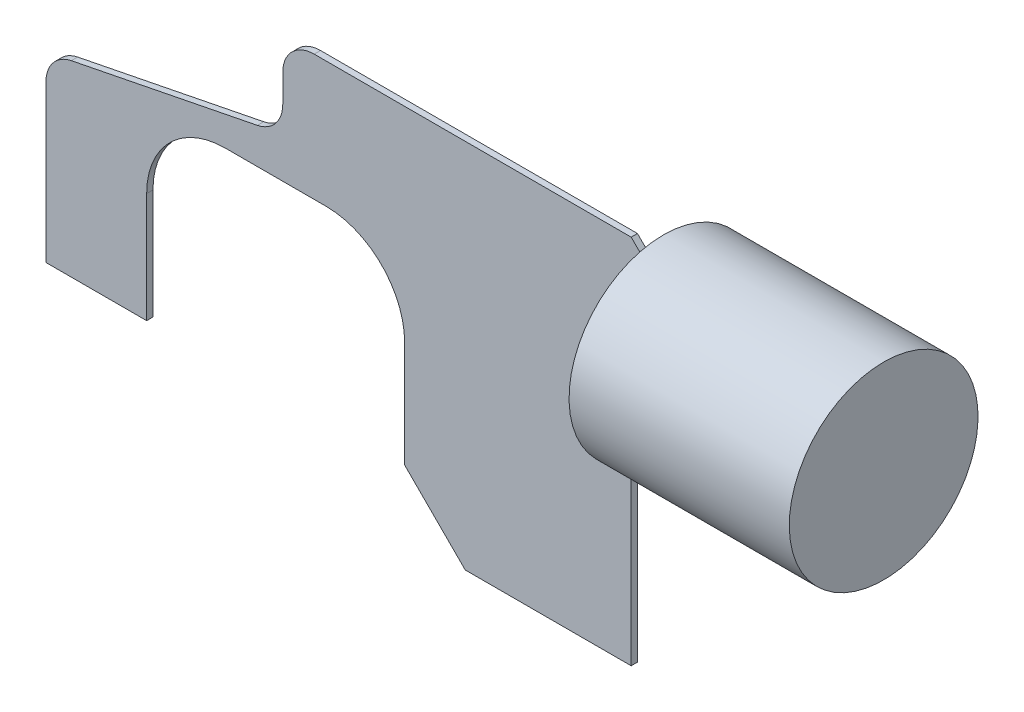
ISO-10303-21;
HEADER;
FILE_DESCRIPTION(('STEP AP214'),'2;1');
FILE_NAME('part.step','',(''),(''),'','','');
FILE_SCHEMA(('AUTOMOTIVE_DESIGN { 1 0 10303 214 1 1 1 1 }'));
ENDSEC;
DATA;
#1=APPLICATION_CONTEXT('core data for automotive mechanical design processes');
#2=APPLICATION_PROTOCOL_DEFINITION('international standard','automotive_design',2000,#1);
#3=PRODUCT_CONTEXT('',#1,'mechanical');
#4=PRODUCT('Part','Part','',(#3));
#5=PRODUCT_RELATED_PRODUCT_CATEGORY('part','',(#4));
#6=PRODUCT_DEFINITION_FORMATION('','',#4);
#7=PRODUCT_DEFINITION_CONTEXT('part definition',#1,'design');
#8=PRODUCT_DEFINITION('design','',#6,#7);
#9=PRODUCT_DEFINITION_SHAPE('','',#8);
#10=(LENGTH_UNIT() NAMED_UNIT(*) SI_UNIT(.MILLI.,.METRE.));
#11=(NAMED_UNIT(*) PLANE_ANGLE_UNIT() SI_UNIT($,.RADIAN.));
#12=(NAMED_UNIT(*) SI_UNIT($,.STERADIAN.) SOLID_ANGLE_UNIT());
#13=UNCERTAINTY_MEASURE_WITH_UNIT(LENGTH_MEASURE(1.E-05),#10,'distance_accuracy_value','');
#14=(GEOMETRIC_REPRESENTATION_CONTEXT(3) GLOBAL_UNCERTAINTY_ASSIGNED_CONTEXT((#13)) GLOBAL_UNIT_ASSIGNED_CONTEXT((#10,
#11,#12)) REPRESENTATION_CONTEXT('',''));
#15=CARTESIAN_POINT('',(0.,0.,0.));
#16=DIRECTION('',(0.,0.,1.));
#17=DIRECTION('',(1.,0.,0.));
#18=AXIS2_PLACEMENT_3D('',#15,#16,#17);
#19=CARTESIAN_POINT('',(0.,0.,-0.127));
#20=DIRECTION('',(-1.,0.,0.));
#21=DIRECTION('',(0.,0.,1.));
#22=AXIS2_PLACEMENT_3D('',#19,#20,#21);
#23=PLANE('',#22);
#24=DIRECTION('',(0.,-1.,0.));
#25=VECTOR('',#24,1.);
#26=CARTESIAN_POINT('',(0.,0.,0.127));
#27=LINE('',#26,#25);
#28=CARTESIAN_POINT('',(0.,6.32367812699813,0.127));
#29=VERTEX_POINT('',#28);
#30=CARTESIAN_POINT('',(0.,0.,0.127));
#31=VERTEX_POINT('',#30);
#32=EDGE_CURVE('E121',#29,#31,#27,.T.);
#33=ORIENTED_EDGE('',*,*,#32,.F.);
#34=DIRECTION('',(0.,0.,-1.));
#35=VECTOR('',#34,1.);
#36=CARTESIAN_POINT('',(0.,6.32367812699813,2.413));
#37=LINE('',#36,#35);
#38=CARTESIAN_POINT('',(0.,6.32367812699813,-0.127));
#39=VERTEX_POINT('',#38);
#40=EDGE_CURVE('E276',#29,#39,#37,.T.);
#41=ORIENTED_EDGE('',*,*,#40,.T.);
#42=DIRECTION('',(0.,-1.,0.));
#43=VECTOR('',#42,1.);
#44=CARTESIAN_POINT('',(0.,0.,-0.127));
#45=LINE('',#44,#43);
#46=CARTESIAN_POINT('',(0.,0.,-0.127));
#47=VERTEX_POINT('',#46);
#48=EDGE_CURVE('E74',#39,#47,#45,.T.);
#49=ORIENTED_EDGE('',*,*,#48,.T.);
#50=DIRECTION('',(0.,0.,1.));
#51=VECTOR('',#50,1.);
#52=CARTESIAN_POINT('',(0.,0.,-0.127));
#53=LINE('',#52,#51);
#54=EDGE_CURVE('E236',#47,#31,#53,.T.);
#55=ORIENTED_EDGE('',*,*,#54,.T.);
#56=EDGE_LOOP('',(#33,#41,#49,#55));
#57=FACE_BOUND('',#56,.T.);
#58=ADVANCED_FACE('F50',(#57),#23,.T.);
#59=CARTESIAN_POINT('',(3.175,9.525,-0.127));
#60=DIRECTION('',(0.,0.,-1.));
#61=DIRECTION('',(-1.,0.,0.));
#62=AXIS2_PLACEMENT_3D('',#59,#60,#61);
#63=PLANE('',#62);
#64=DIRECTION('',(0.,-1.,0.));
#65=VECTOR('',#64,1.);
#66=CARTESIAN_POINT('',(9.55704806959373,0.,-0.127));
#67=LINE('',#66,#65);
#68=CARTESIAN_POINT('',(9.55704806959373,11.43,-0.127));
#69=VERTEX_POINT('',#68);
#70=CARTESIAN_POINT('',(9.55704806959373,10.3087777878284,-0.127));
#71=VERTEX_POINT('',#70);
#72=EDGE_CURVE('E414',#69,#71,#67,.T.);
#73=ORIENTED_EDGE('',*,*,#72,.F.);
#74=CARTESIAN_POINT('',(10.8270480695937,11.43,-0.127));
#75=DIRECTION('',(0.,0.,-1.));
#76=DIRECTION('',(-1.,0.,0.));
#77=AXIS2_PLACEMENT_3D('',#74,#75,#76);
#78=CIRCLE('',#77,1.27);
#79=CARTESIAN_POINT('',(10.8270480695937,12.7,-0.127));
#80=VERTEX_POINT('',#79);
#81=EDGE_CURVE('E416',#69,#80,#78,.T.);
#82=ORIENTED_EDGE('',*,*,#81,.T.);
#83=DIRECTION('',(-1.,0.,0.));
#84=VECTOR('',#83,1.);
#85=CARTESIAN_POINT('',(3.17500000000002,12.7,-0.127));
#86=LINE('',#85,#84);
#87=CARTESIAN_POINT('',(23.622,12.7,-0.127));
#88=VERTEX_POINT('',#87);
#89=EDGE_CURVE('E184',#88,#80,#86,.T.);
#90=ORIENTED_EDGE('',*,*,#89,.F.);
#91=DIRECTION('',(-0.707106781186548,0.707106781186547,0.));
#92=VECTOR('',#91,1.);
#93=CARTESIAN_POINT('',(23.622,12.7,-0.127));
#94=LINE('',#93,#92);
#95=CARTESIAN_POINT('',(24.7970480695937,11.5249519304063,-0.127));
#96=VERTEX_POINT('',#95);
#97=EDGE_CURVE('E166',#96,#88,#94,.T.);
#98=ORIENTED_EDGE('',*,*,#97,.F.);
#99=DIRECTION('',(0.,1.,0.));
#100=VECTOR('',#99,1.);
#101=CARTESIAN_POINT('',(24.7970480695937,11.5249519304063,-0.127));
#102=LINE('',#101,#100);
#103=CARTESIAN_POINT('',(24.7970480695937,7.52504806959373,-0.127));
#104=VERTEX_POINT('',#103);
#105=EDGE_CURVE('E180',#104,#96,#102,.T.);
#106=ORIENTED_EDGE('',*,*,#105,.F.);
#107=DIRECTION('',(0.707106781186549,0.707106781186547,0.));
#108=VECTOR('',#107,1.);
#109=CARTESIAN_POINT('',(24.7970480695937,7.52504806959373,-0.127));
#110=LINE('',#109,#108);
#111=CARTESIAN_POINT('',(23.622,6.35,-0.127));
#112=VERTEX_POINT('',#111);
#113=EDGE_CURVE('E189',#112,#104,#110,.T.);
#114=ORIENTED_EDGE('',*,*,#113,.F.);
#115=DIRECTION('',(0.,1.,0.));
#116=VECTOR('',#115,1.);
#117=CARTESIAN_POINT('',(23.622,6.35,-0.127));
#118=LINE('',#117,#116);
#119=CARTESIAN_POINT('',(23.622,-2.286,-0.127));
#120=VERTEX_POINT('',#119);
#121=EDGE_CURVE('E191',#120,#112,#118,.T.);
#122=ORIENTED_EDGE('',*,*,#121,.F.);
#123=DIRECTION('',(1.,0.,0.));
#124=VECTOR('',#123,1.);
#125=CARTESIAN_POINT('',(23.622,-2.286,-0.127));
#126=LINE('',#125,#124);
#127=CARTESIAN_POINT('',(16.9236964602605,-2.286,-0.127));
#128=VERTEX_POINT('',#127);
#129=EDGE_CURVE('E334',#128,#120,#126,.T.);
#130=ORIENTED_EDGE('',*,*,#129,.F.);
#131=DIRECTION('',(0.707106781186548,-0.707106781186547,0.));
#132=VECTOR('',#131,1.);
#133=CARTESIAN_POINT('',(16.9236964602605,-2.286,-0.127));
#134=LINE('',#133,#132);
#135=CARTESIAN_POINT('',(14.478,0.159696460260486,-0.127));
#136=VERTEX_POINT('',#135);
#137=EDGE_CURVE('E331',#136,#128,#134,.T.);
#138=ORIENTED_EDGE('',*,*,#137,.F.);
#139=DIRECTION('',(0.,-1.,0.));
#140=VECTOR('',#139,1.);
#141=CARTESIAN_POINT('',(14.478,0.159696460260486,-0.127));
#142=LINE('',#141,#140);
#143=CARTESIAN_POINT('',(14.478,4.445,-0.127));
#144=VERTEX_POINT('',#143);
#145=EDGE_CURVE('E328',#144,#136,#142,.T.);
#146=ORIENTED_EDGE('',*,*,#145,.F.);
#147=CARTESIAN_POINT('',(11.303,4.445,-0.127));
#148=DIRECTION('',(0.,0.,-1.));
#149=DIRECTION('',(1.,0.,0.));
#150=AXIS2_PLACEMENT_3D('',#147,#148,#149);
#151=CIRCLE('',#150,3.175);
#152=CARTESIAN_POINT('',(11.303,7.62,-0.127));
#153=VERTEX_POINT('',#152);
#154=EDGE_CURVE('E325',#153,#144,#151,.T.);
#155=ORIENTED_EDGE('',*,*,#154,.F.);
#156=DIRECTION('',(1.,0.,0.));
#157=VECTOR('',#156,1.);
#158=CARTESIAN_POINT('',(11.303,7.62,-0.127));
#159=LINE('',#158,#157);
#160=CARTESIAN_POINT('',(7.239,7.62,-0.127));
#161=VERTEX_POINT('',#160);
#162=EDGE_CURVE('E322',#161,#153,#159,.T.);
#163=ORIENTED_EDGE('',*,*,#162,.F.);
#164=CARTESIAN_POINT('',(7.239,4.445,-0.127));
#165=DIRECTION('',(0.,0.,-1.));
#166=DIRECTION('',(1.,0.,0.));
#167=AXIS2_PLACEMENT_3D('',#164,#165,#166);
#168=CIRCLE('',#167,3.175);
#169=CARTESIAN_POINT('',(4.064,4.445,-0.127));
#170=VERTEX_POINT('',#169);
#171=EDGE_CURVE('E319',#170,#161,#168,.T.);
#172=ORIENTED_EDGE('',*,*,#171,.F.);
#173=DIRECTION('',(0.,1.,0.));
#174=VECTOR('',#173,1.);
#175=CARTESIAN_POINT('',(4.064,4.445,-0.127));
#176=LINE('',#175,#174);
#177=CARTESIAN_POINT('',(4.064,0.,-0.127));
#178=VERTEX_POINT('',#177);
#179=EDGE_CURVE('E317',#178,#170,#176,.T.);
#180=ORIENTED_EDGE('',*,*,#179,.F.);
#181=DIRECTION('',(1.,0.,0.));
#182=VECTOR('',#181,1.);
#183=CARTESIAN_POINT('',(4.064,0.,-0.127));
#184=LINE('',#183,#182);
#185=EDGE_CURVE('E235',#47,#178,#184,.T.);
#186=ORIENTED_EDGE('',*,*,#185,.F.);
#187=ORIENTED_EDGE('',*,*,#48,.F.);
#188=CARTESIAN_POINT('',(1.27,6.32367812699814,-0.127));
#189=DIRECTION('',(0.,0.,-1.));
#190=DIRECTION('',(-1.,0.,0.));
#191=AXIS2_PLACEMENT_3D('',#188,#189,#190);
#192=CIRCLE('',#191,1.27);
#193=CARTESIAN_POINT('',(1.02230539314557,7.56928937523542,-0.127));
#194=VERTEX_POINT('',#193);
#195=EDGE_CURVE('E308',#39,#194,#192,.T.);
#196=ORIENTED_EDGE('',*,*,#195,.T.);
#197=DIRECTION('',(-0.980796258454548,-0.195035123507434,0.));
#198=VECTOR('',#197,1.);
#199=CARTESIAN_POINT('',(-1.40904007312479,7.08580694020811,-0.127));
#200=LINE('',#199,#198);
#201=CARTESIAN_POINT('',(8.53474267644816,9.06316653959113,-0.127));
#202=VERTEX_POINT('',#201);
#203=EDGE_CURVE('E285',#202,#194,#200,.T.);
#204=ORIENTED_EDGE('',*,*,#203,.F.);
#205=CARTESIAN_POINT('',(8.28704806959373,10.3087777878284,-0.127));
#206=DIRECTION('',(0.,0.,-1.));
#207=DIRECTION('',(-1.,0.,0.));
#208=AXIS2_PLACEMENT_3D('',#205,#206,#207);
#209=CIRCLE('',#208,1.27);
#210=EDGE_CURVE('E300',#202,#71,#209,.F.);
#211=ORIENTED_EDGE('',*,*,#210,.T.);
#212=EDGE_LOOP('',(#73,#82,#90,#98,#106,#114,#122,#130,#138,#146,#155,#163,#172,#180,#186,#187,
#196,#204,#211));
#213=FACE_BOUND('',#212,.T.);
#214=ADVANCED_FACE('F178',(#213),#63,.T.);
#215=CARTESIAN_POINT('',(3.175,9.525,0.127));
#216=DIRECTION('',(0.,0.,-1.));
#217=DIRECTION('',(-1.,0.,0.));
#218=AXIS2_PLACEMENT_3D('',#215,#216,#217);
#219=PLANE('',#218);
#220=CARTESIAN_POINT('',(10.8270480695937,11.43,0.127));
#221=DIRECTION('',(0.,0.,-1.));
#222=DIRECTION('',(-1.,0.,0.));
#223=AXIS2_PLACEMENT_3D('',#220,#221,#222);
#224=CIRCLE('',#223,1.27);
#225=CARTESIAN_POINT('',(9.55704806959373,11.43,0.127));
#226=VERTEX_POINT('',#225);
#227=CARTESIAN_POINT('',(10.8270480695937,12.7,0.127));
#228=VERTEX_POINT('',#227);
#229=EDGE_CURVE('E13',#226,#228,#224,.T.);
#230=ORIENTED_EDGE('',*,*,#229,.F.);
#231=DIRECTION('',(0.,-1.,0.));
#232=VECTOR('',#231,1.);
#233=CARTESIAN_POINT('',(9.55704806959373,9.525,0.127));
#234=LINE('',#233,#232);
#235=CARTESIAN_POINT('',(9.55704806959373,10.3087777878284,0.127));
#236=VERTEX_POINT('',#235);
#237=EDGE_CURVE('E238',#226,#236,#234,.T.);
#238=ORIENTED_EDGE('',*,*,#237,.T.);
#239=CARTESIAN_POINT('',(8.28704806959373,10.3087777878284,0.127));
#240=DIRECTION('',(0.,0.,-1.));
#241=DIRECTION('',(-1.,0.,0.));
#242=AXIS2_PLACEMENT_3D('',#239,#240,#241);
#243=CIRCLE('',#242,1.27);
#244=CARTESIAN_POINT('',(8.53474267644816,9.06316653959113,0.127));
#245=VERTEX_POINT('',#244);
#246=EDGE_CURVE('E260',#245,#236,#243,.F.);
#247=ORIENTED_EDGE('',*,*,#246,.F.);
#248=DIRECTION('',(-0.980796258454548,-0.195035123507434,0.));
#249=VECTOR('',#248,1.);
#250=CARTESIAN_POINT('',(3.4672216335918,8.05547041111348,0.127));
#251=LINE('',#250,#249);
#252=CARTESIAN_POINT('',(1.02230539314557,7.56928937523542,0.127));
#253=VERTEX_POINT('',#252);
#254=EDGE_CURVE('E262',#245,#253,#251,.T.);
#255=ORIENTED_EDGE('',*,*,#254,.T.);
#256=CARTESIAN_POINT('',(1.27,6.32367812699814,0.127));
#257=DIRECTION('',(0.,0.,-1.));
#258=DIRECTION('',(-1.,0.,0.));
#259=AXIS2_PLACEMENT_3D('',#256,#257,#258);
#260=CIRCLE('',#259,1.27);
#261=EDGE_CURVE('E58',#29,#253,#260,.T.);
#262=ORIENTED_EDGE('',*,*,#261,.F.);
#263=ORIENTED_EDGE('',*,*,#32,.T.);
#264=DIRECTION('',(1.,0.,0.));
#265=VECTOR('',#264,1.);
#266=CARTESIAN_POINT('',(4.064,0.,0.127));
#267=LINE('',#266,#265);
#268=CARTESIAN_POINT('',(4.064,0.,0.127));
#269=VERTEX_POINT('',#268);
#270=EDGE_CURVE('E197',#31,#269,#267,.T.);
#271=ORIENTED_EDGE('',*,*,#270,.T.);
#272=DIRECTION('',(0.,1.,0.));
#273=VECTOR('',#272,1.);
#274=CARTESIAN_POINT('',(4.064,4.445,0.127));
#275=LINE('',#274,#273);
#276=CARTESIAN_POINT('',(4.064,4.445,0.127));
#277=VERTEX_POINT('',#276);
#278=EDGE_CURVE('E199',#269,#277,#275,.T.);
#279=ORIENTED_EDGE('',*,*,#278,.T.);
#280=CARTESIAN_POINT('',(7.239,4.445,0.127));
#281=DIRECTION('',(0.,0.,-1.));
#282=DIRECTION('',(1.,0.,0.));
#283=AXIS2_PLACEMENT_3D('',#280,#281,#282);
#284=CIRCLE('',#283,3.175);
#285=CARTESIAN_POINT('',(7.239,7.62,0.127));
#286=VERTEX_POINT('',#285);
#287=EDGE_CURVE('E203',#277,#286,#284,.T.);
#288=ORIENTED_EDGE('',*,*,#287,.T.);
#289=DIRECTION('',(1.,0.,0.));
#290=VECTOR('',#289,1.);
#291=CARTESIAN_POINT('',(11.303,7.62,0.127));
#292=LINE('',#291,#290);
#293=CARTESIAN_POINT('',(11.303,7.62,0.127));
#294=VERTEX_POINT('',#293);
#295=EDGE_CURVE('E206',#286,#294,#292,.T.);
#296=ORIENTED_EDGE('',*,*,#295,.T.);
#297=CARTESIAN_POINT('',(11.303,4.445,0.127));
#298=DIRECTION('',(0.,0.,-1.));
#299=DIRECTION('',(1.,0.,0.));
#300=AXIS2_PLACEMENT_3D('',#297,#298,#299);
#301=CIRCLE('',#300,3.175);
#302=CARTESIAN_POINT('',(14.478,4.445,0.127));
#303=VERTEX_POINT('',#302);
#304=EDGE_CURVE('E209',#294,#303,#301,.T.);
#305=ORIENTED_EDGE('',*,*,#304,.T.);
#306=DIRECTION('',(0.,-1.,0.));
#307=VECTOR('',#306,1.);
#308=CARTESIAN_POINT('',(14.478,0.159696460260486,0.127));
#309=LINE('',#308,#307);
#310=CARTESIAN_POINT('',(14.478,0.159696460260486,0.127));
#311=VERTEX_POINT('',#310);
#312=EDGE_CURVE('E212',#303,#311,#309,.T.);
#313=ORIENTED_EDGE('',*,*,#312,.T.);
#314=DIRECTION('',(0.707106781186548,-0.707106781186547,0.));
#315=VECTOR('',#314,1.);
#316=CARTESIAN_POINT('',(16.9236964602605,-2.286,0.127));
#317=LINE('',#316,#315);
#318=CARTESIAN_POINT('',(16.9236964602605,-2.286,0.127));
#319=VERTEX_POINT('',#318);
#320=EDGE_CURVE('E215',#311,#319,#317,.T.);
#321=ORIENTED_EDGE('',*,*,#320,.T.);
#322=DIRECTION('',(1.,0.,0.));
#323=VECTOR('',#322,1.);
#324=CARTESIAN_POINT('',(23.622,-2.286,0.127));
#325=LINE('',#324,#323);
#326=CARTESIAN_POINT('',(23.622,-2.286,0.127));
#327=VERTEX_POINT('',#326);
#328=EDGE_CURVE('E218',#319,#327,#325,.T.);
#329=ORIENTED_EDGE('',*,*,#328,.T.);
#330=DIRECTION('',(0.,1.,0.));
#331=VECTOR('',#330,1.);
#332=CARTESIAN_POINT('',(23.622,6.35,0.127));
#333=LINE('',#332,#331);
#334=CARTESIAN_POINT('',(23.622,6.35,0.127));
#335=VERTEX_POINT('',#334);
#336=EDGE_CURVE('E221',#327,#335,#333,.T.);
#337=ORIENTED_EDGE('',*,*,#336,.T.);
#338=DIRECTION('',(0.707106781186549,0.707106781186547,0.));
#339=VECTOR('',#338,1.);
#340=CARTESIAN_POINT('',(24.7970480695937,7.52504806959373,0.127));
#341=LINE('',#340,#339);
#342=CARTESIAN_POINT('',(24.7970480695937,7.52504806959373,0.127));
#343=VERTEX_POINT('',#342);
#344=EDGE_CURVE('E224',#335,#343,#341,.T.);
#345=ORIENTED_EDGE('',*,*,#344,.T.);
#346=DIRECTION('',(0.,1.,0.));
#347=VECTOR('',#346,1.);
#348=CARTESIAN_POINT('',(24.7970480695937,11.5249519304063,0.127));
#349=LINE('',#348,#347);
#350=CARTESIAN_POINT('',(24.7970480695937,11.5249519304063,0.127));
#351=VERTEX_POINT('',#350);
#352=EDGE_CURVE('E227',#343,#351,#349,.T.);
#353=ORIENTED_EDGE('',*,*,#352,.T.);
#354=DIRECTION('',(-0.707106781186548,0.707106781186547,0.));
#355=VECTOR('',#354,1.);
#356=CARTESIAN_POINT('',(23.622,12.7,0.127));
#357=LINE('',#356,#355);
#358=CARTESIAN_POINT('',(23.622,12.7,0.127));
#359=VERTEX_POINT('',#358);
#360=EDGE_CURVE('E168',#351,#359,#357,.T.);
#361=ORIENTED_EDGE('',*,*,#360,.T.);
#362=DIRECTION('',(-1.,0.,0.));
#363=VECTOR('',#362,1.);
#364=CARTESIAN_POINT('',(3.17500000000002,12.7,0.127));
#365=LINE('',#364,#363);
#366=EDGE_CURVE('E231',#359,#228,#365,.T.);
#367=ORIENTED_EDGE('',*,*,#366,.T.);
#368=EDGE_LOOP('',(#230,#238,#247,#255,#262,#263,#271,#279,#288,#296,#305,#313,#321,#329,#337,
#345,#353,#361,#367));
#369=FACE_BOUND('',#368,.T.);
#370=ADVANCED_FACE('F291',(#369),#219,.F.);
#371=CARTESIAN_POINT('',(4.064,0.,-0.127));
#372=DIRECTION('',(0.,-1.,0.));
#373=DIRECTION('',(1.,0.,0.));
#374=AXIS2_PLACEMENT_3D('',#371,#372,#373);
#375=PLANE('',#374);
#376=ORIENTED_EDGE('',*,*,#270,.F.);
#377=ORIENTED_EDGE('',*,*,#54,.F.);
#378=ORIENTED_EDGE('',*,*,#185,.T.);
#379=DIRECTION('',(0.,0.,1.));
#380=VECTOR('',#379,1.);
#381=CARTESIAN_POINT('',(4.064,0.,-0.127));
#382=LINE('',#381,#380);
#383=EDGE_CURVE('E128',#178,#269,#382,.T.);
#384=ORIENTED_EDGE('',*,*,#383,.T.);
#385=EDGE_LOOP('',(#376,#377,#378,#384));
#386=FACE_BOUND('',#385,.T.);
#387=ADVANCED_FACE('F52',(#386),#375,.T.);
#388=CARTESIAN_POINT('',(3.17500000000002,12.7,-0.127));
#389=DIRECTION('',(0.,1.,0.));
#390=DIRECTION('',(0.,0.,1.));
#391=AXIS2_PLACEMENT_3D('',#388,#389,#390);
#392=PLANE('',#391);
#393=DIRECTION('',(0.,0.,-1.));
#394=VECTOR('',#393,1.);
#395=CARTESIAN_POINT('',(10.8270480695937,12.7,2.413));
#396=LINE('',#395,#394);
#397=EDGE_CURVE('E314',#228,#80,#396,.T.);
#398=ORIENTED_EDGE('',*,*,#397,.F.);
#399=ORIENTED_EDGE('',*,*,#366,.F.);
#400=DIRECTION('',(0.,0.,1.));
#401=VECTOR('',#400,1.);
#402=CARTESIAN_POINT('',(23.622,12.7,-0.127));
#403=LINE('',#402,#401);
#404=EDGE_CURVE('E172',#88,#359,#403,.T.);
#405=ORIENTED_EDGE('',*,*,#404,.F.);
#406=ORIENTED_EDGE('',*,*,#89,.T.);
#407=EDGE_LOOP('',(#398,#399,#405,#406));
#408=FACE_BOUND('',#407,.T.);
#409=ADVANCED_FACE('F392',(#408),#392,.T.);
#410=CARTESIAN_POINT('',(23.622,12.7,-0.127));
#411=DIRECTION('',(0.707106781186547,0.707106781186548,0.));
#412=DIRECTION('',(-0.707106781186548,0.707106781186547,0.));
#413=AXIS2_PLACEMENT_3D('',#410,#411,#412);
#414=PLANE('',#413);
#415=ORIENTED_EDGE('',*,*,#360,.F.);
#416=DIRECTION('',(0.,0.,1.));
#417=VECTOR('',#416,1.);
#418=CARTESIAN_POINT('',(24.7970480695937,11.5249519304063,-0.127));
#419=LINE('',#418,#417);
#420=EDGE_CURVE('E163',#96,#351,#419,.T.);
#421=ORIENTED_EDGE('',*,*,#420,.F.);
#422=ORIENTED_EDGE('',*,*,#97,.T.);
#423=ORIENTED_EDGE('',*,*,#404,.T.);
#424=EDGE_LOOP('',(#415,#421,#422,#423));
#425=FACE_BOUND('',#424,.T.);
#426=ADVANCED_FACE('F165',(#425),#414,.T.);
#427=CARTESIAN_POINT('',(24.7970480695937,7.52504806959373,-0.127));
#428=DIRECTION('',(0.707106781186546,-0.707106781186549,0.));
#429=DIRECTION('',(0.707106781186549,0.707106781186546,0.));
#430=AXIS2_PLACEMENT_3D('',#427,#428,#429);
#431=PLANE('',#430);
#432=ORIENTED_EDGE('',*,*,#344,.F.);
#433=DIRECTION('',(0.,0.,1.));
#434=VECTOR('',#433,1.);
#435=CARTESIAN_POINT('',(23.622,6.35,-0.127));
#436=LINE('',#435,#434);
#437=EDGE_CURVE('E241',#112,#335,#436,.T.);
#438=ORIENTED_EDGE('',*,*,#437,.F.);
#439=ORIENTED_EDGE('',*,*,#113,.T.);
#440=DIRECTION('',(0.,0.,1.));
#441=VECTOR('',#440,1.);
#442=CARTESIAN_POINT('',(24.7970480695937,7.52504806959373,-0.127));
#443=LINE('',#442,#441);
#444=EDGE_CURVE('E173',#104,#343,#443,.T.);
#445=ORIENTED_EDGE('',*,*,#444,.T.);
#446=EDGE_LOOP('',(#432,#438,#439,#445));
#447=FACE_BOUND('',#446,.T.);
#448=ADVANCED_FACE('F384',(#447),#431,.T.);
#449=CARTESIAN_POINT('',(23.622,6.35,-0.127));
#450=DIRECTION('',(1.,0.,0.));
#451=DIRECTION('',(0.,0.,-1.));
#452=AXIS2_PLACEMENT_3D('',#449,#450,#451);
#453=PLANE('',#452);
#454=ORIENTED_EDGE('',*,*,#336,.F.);
#455=DIRECTION('',(0.,0.,1.));
#456=VECTOR('',#455,1.);
#457=CARTESIAN_POINT('',(23.622,-2.286,-0.127));
#458=LINE('',#457,#456);
#459=EDGE_CURVE('E243',#120,#327,#458,.T.);
#460=ORIENTED_EDGE('',*,*,#459,.F.);
#461=ORIENTED_EDGE('',*,*,#121,.T.);
#462=ORIENTED_EDGE('',*,*,#437,.T.);
#463=EDGE_LOOP('',(#454,#460,#461,#462));
#464=FACE_BOUND('',#463,.T.);
#465=ADVANCED_FACE('F340',(#464),#453,.T.);
#466=CARTESIAN_POINT('',(23.622,-2.286,-0.127));
#467=DIRECTION('',(0.,-1.,0.));
#468=DIRECTION('',(1.,0.,0.));
#469=AXIS2_PLACEMENT_3D('',#466,#467,#468);
#470=PLANE('',#469);
#471=ORIENTED_EDGE('',*,*,#328,.F.);
#472=DIRECTION('',(0.,0.,1.));
#473=VECTOR('',#472,1.);
#474=CARTESIAN_POINT('',(16.9236964602605,-2.286,-0.127));
#475=LINE('',#474,#473);
#476=EDGE_CURVE('E245',#128,#319,#475,.T.);
#477=ORIENTED_EDGE('',*,*,#476,.F.);
#478=ORIENTED_EDGE('',*,*,#129,.T.);
#479=ORIENTED_EDGE('',*,*,#459,.T.);
#480=EDGE_LOOP('',(#471,#477,#478,#479));
#481=FACE_BOUND('',#480,.T.);
#482=ADVANCED_FACE('F346',(#481),#470,.T.);
#483=CARTESIAN_POINT('',(16.9236964602605,-2.286,-0.127));
#484=DIRECTION('',(-0.707106781186547,-0.707106781186548,0.));
#485=DIRECTION('',(0.707106781186548,-0.707106781186547,0.));
#486=AXIS2_PLACEMENT_3D('',#483,#484,#485);
#487=PLANE('',#486);
#488=ORIENTED_EDGE('',*,*,#320,.F.);
#489=DIRECTION('',(0.,0.,1.));
#490=VECTOR('',#489,1.);
#491=CARTESIAN_POINT('',(14.478,0.159696460260486,-0.127));
#492=LINE('',#491,#490);
#493=EDGE_CURVE('E247',#136,#311,#492,.T.);
#494=ORIENTED_EDGE('',*,*,#493,.F.);
#495=ORIENTED_EDGE('',*,*,#137,.T.);
#496=ORIENTED_EDGE('',*,*,#476,.T.);
#497=EDGE_LOOP('',(#488,#494,#495,#496));
#498=FACE_BOUND('',#497,.T.);
#499=ADVANCED_FACE('F349',(#498),#487,.T.);
#500=CARTESIAN_POINT('',(14.478,0.159696460260486,-0.127));
#501=DIRECTION('',(-1.,0.,0.));
#502=DIRECTION('',(0.,0.,1.));
#503=AXIS2_PLACEMENT_3D('',#500,#501,#502);
#504=PLANE('',#503);
#505=ORIENTED_EDGE('',*,*,#312,.F.);
#506=DIRECTION('',(0.,0.,1.));
#507=VECTOR('',#506,1.);
#508=CARTESIAN_POINT('',(14.478,4.445,-0.127));
#509=LINE('',#508,#507);
#510=EDGE_CURVE('E249',#144,#303,#509,.T.);
#511=ORIENTED_EDGE('',*,*,#510,.F.);
#512=ORIENTED_EDGE('',*,*,#145,.T.);
#513=ORIENTED_EDGE('',*,*,#493,.T.);
#514=EDGE_LOOP('',(#505,#511,#512,#513));
#515=FACE_BOUND('',#514,.T.);
#516=ADVANCED_FACE('F354',(#515),#504,.T.);
#517=CARTESIAN_POINT('',(11.303,4.445,-0.127));
#518=DIRECTION('',(0.,0.,1.));
#519=DIRECTION('',(1.,0.,0.));
#520=AXIS2_PLACEMENT_3D('',#517,#518,#519);
#521=CYLINDRICAL_SURFACE('',#520,3.175);
#522=ORIENTED_EDGE('',*,*,#304,.F.);
#523=DIRECTION('',(0.,0.,1.));
#524=VECTOR('',#523,1.);
#525=CARTESIAN_POINT('',(11.303,7.62,-0.127));
#526=LINE('',#525,#524);
#527=EDGE_CURVE('E251',#153,#294,#526,.T.);
#528=ORIENTED_EDGE('',*,*,#527,.F.);
#529=ORIENTED_EDGE('',*,*,#154,.T.);
#530=ORIENTED_EDGE('',*,*,#510,.T.);
#531=EDGE_LOOP('',(#522,#528,#529,#530));
#532=FACE_BOUND('',#531,.T.);
#533=ADVANCED_FACE('F357',(#532),#521,.F.);
#534=CARTESIAN_POINT('',(11.303,7.62,-0.127));
#535=DIRECTION('',(0.,-1.,0.));
#536=DIRECTION('',(1.,0.,0.));
#537=AXIS2_PLACEMENT_3D('',#534,#535,#536);
#538=PLANE('',#537);
#539=ORIENTED_EDGE('',*,*,#295,.F.);
#540=DIRECTION('',(0.,0.,1.));
#541=VECTOR('',#540,1.);
#542=CARTESIAN_POINT('',(7.239,7.62,-0.127));
#543=LINE('',#542,#541);
#544=EDGE_CURVE('E253',#161,#286,#543,.T.);
#545=ORIENTED_EDGE('',*,*,#544,.F.);
#546=ORIENTED_EDGE('',*,*,#162,.T.);
#547=ORIENTED_EDGE('',*,*,#527,.T.);
#548=EDGE_LOOP('',(#539,#545,#546,#547));
#549=FACE_BOUND('',#548,.T.);
#550=ADVANCED_FACE('F362',(#549),#538,.T.);
#551=CARTESIAN_POINT('',(7.239,4.445,-0.127));
#552=DIRECTION('',(0.,0.,1.));
#553=DIRECTION('',(1.,0.,0.));
#554=AXIS2_PLACEMENT_3D('',#551,#552,#553);
#555=CYLINDRICAL_SURFACE('',#554,3.175);
#556=ORIENTED_EDGE('',*,*,#287,.F.);
#557=DIRECTION('',(0.,0.,1.));
#558=VECTOR('',#557,1.);
#559=CARTESIAN_POINT('',(4.064,4.445,-0.127));
#560=LINE('',#559,#558);
#561=EDGE_CURVE('E255',#170,#277,#560,.T.);
#562=ORIENTED_EDGE('',*,*,#561,.F.);
#563=ORIENTED_EDGE('',*,*,#171,.T.);
#564=ORIENTED_EDGE('',*,*,#544,.T.);
#565=EDGE_LOOP('',(#556,#562,#563,#564));
#566=FACE_BOUND('',#565,.T.);
#567=ADVANCED_FACE('F365',(#566),#555,.F.);
#568=CARTESIAN_POINT('',(4.064,4.445,-0.127));
#569=DIRECTION('',(1.,0.,0.));
#570=DIRECTION('',(0.,0.,-1.));
#571=AXIS2_PLACEMENT_3D('',#568,#569,#570);
#572=PLANE('',#571);
#573=ORIENTED_EDGE('',*,*,#278,.F.);
#574=ORIENTED_EDGE('',*,*,#383,.F.);
#575=ORIENTED_EDGE('',*,*,#179,.T.);
#576=ORIENTED_EDGE('',*,*,#561,.T.);
#577=EDGE_LOOP('',(#573,#574,#575,#576));
#578=FACE_BOUND('',#577,.T.);
#579=ADVANCED_FACE('F367',(#578),#572,.T.);
#580=CARTESIAN_POINT('',(33.6870480695937,9.49295193040629,0.));
#581=DIRECTION('',(-1.,0.,0.));
#582=DIRECTION('',(0.,-1.,0.));
#583=AXIS2_PLACEMENT_3D('',#580,#581,#582);
#584=CYLINDRICAL_SURFACE('',#583,3.81);
#585=CARTESIAN_POINT('',(33.6870480695937,9.49295193040629,0.));
#586=DIRECTION('',(1.,0.,0.));
#587=DIRECTION('',(0.,1.,0.));
#588=AXIS2_PLACEMENT_3D('',#585,#586,#587);
#589=CIRCLE('',#588,3.81);
#590=CARTESIAN_POINT('',(33.6870480695937,13.3029519304063,0.));
#591=VERTEX_POINT('',#590);
#592=EDGE_CURVE('E200',#591,#591,#589,.T.);
#593=ORIENTED_EDGE('',*,*,#592,.F.);
#594=EDGE_LOOP('',(#593));
#595=FACE_BOUND('',#594,.T.);
#596=CARTESIAN_POINT('',(24.7970480695937,9.49295193040628,0.));
#597=DIRECTION('',(1.,0.,0.));
#598=DIRECTION('',(0.,1.,0.));
#599=AXIS2_PLACEMENT_3D('',#596,#597,#598);
#600=CIRCLE('',#599,3.81);
#601=CARTESIAN_POINT('',(24.7970480695937,13.3029519304063,0.));
#602=VERTEX_POINT('',#601);
#603=EDGE_CURVE('E311',#602,#602,#600,.T.);
#604=ORIENTED_EDGE('',*,*,#603,.T.);
#605=EDGE_LOOP('',(#604));
#606=FACE_BOUND('',#605,.T.);
#607=ADVANCED_FACE('F435',(#595,#606),#584,.T.);
#608=CARTESIAN_POINT('',(33.6870480695937,9.49295193040629,0.));
#609=DIRECTION('',(1.,0.,0.));
#610=DIRECTION('',(0.,1.,0.));
#611=AXIS2_PLACEMENT_3D('',#608,#609,#610);
#612=PLANE('',#611);
#613=ORIENTED_EDGE('',*,*,#592,.T.);
#614=EDGE_LOOP('',(#613));
#615=FACE_BOUND('',#614,.T.);
#616=ADVANCED_FACE('F432',(#615),#612,.T.);
#617=CARTESIAN_POINT('',(24.7970480695937,9.49295193040628,0.));
#618=DIRECTION('',(1.,0.,0.));
#619=DIRECTION('',(0.,1.,0.));
#620=AXIS2_PLACEMENT_3D('',#617,#618,#619);
#621=PLANE('',#620);
#622=ORIENTED_EDGE('',*,*,#352,.F.);
#623=ORIENTED_EDGE('',*,*,#444,.F.);
#624=ORIENTED_EDGE('',*,*,#105,.T.);
#625=ORIENTED_EDGE('',*,*,#420,.T.);
#626=EDGE_LOOP('',(#622,#623,#624,#625));
#627=FACE_BOUND('',#626,.T.);
#628=ORIENTED_EDGE('',*,*,#603,.F.);
#629=EDGE_LOOP('',(#628));
#630=FACE_BOUND('',#629,.T.);
#631=ADVANCED_FACE('F187',(#627,#630),#621,.F.);
#632=CARTESIAN_POINT('',(10.8270480695937,11.43,2.413));
#633=DIRECTION('',(0.,0.,-1.));
#634=DIRECTION('',(-1.,0.,0.));
#635=AXIS2_PLACEMENT_3D('',#632,#633,#634);
#636=CYLINDRICAL_SURFACE('',#635,1.27);
#637=ORIENTED_EDGE('',*,*,#229,.T.);
#638=ORIENTED_EDGE('',*,*,#397,.T.);
#639=ORIENTED_EDGE('',*,*,#81,.F.);
#640=DIRECTION('',(0.,0.,-1.));
#641=VECTOR('',#640,1.);
#642=CARTESIAN_POINT('',(9.55704806959373,11.43,2.413));
#643=LINE('',#642,#641);
#644=EDGE_CURVE('E302',#226,#69,#643,.T.);
#645=ORIENTED_EDGE('',*,*,#644,.F.);
#646=EDGE_LOOP('',(#637,#638,#639,#645));
#647=FACE_BOUND('',#646,.T.);
#648=ADVANCED_FACE('F418',(#647),#636,.T.);
#649=CARTESIAN_POINT('',(1.27,6.32367812699814,2.413));
#650=DIRECTION('',(0.,0.,-1.));
#651=DIRECTION('',(-1.,0.,0.));
#652=AXIS2_PLACEMENT_3D('',#649,#650,#651);
#653=CYLINDRICAL_SURFACE('',#652,1.27);
#654=ORIENTED_EDGE('',*,*,#261,.T.);
#655=DIRECTION('',(0.,0.,-1.));
#656=VECTOR('',#655,1.);
#657=CARTESIAN_POINT('',(1.02230539314557,7.56928937523542,2.413));
#658=LINE('',#657,#656);
#659=EDGE_CURVE('E273',#253,#194,#658,.T.);
#660=ORIENTED_EDGE('',*,*,#659,.T.);
#661=ORIENTED_EDGE('',*,*,#195,.F.);
#662=ORIENTED_EDGE('',*,*,#40,.F.);
#663=EDGE_LOOP('',(#654,#660,#661,#662));
#664=FACE_BOUND('',#663,.T.);
#665=ADVANCED_FACE('F270',(#664),#653,.T.);
#666=CARTESIAN_POINT('',(-1.40904007312479,7.08580694020811,2.413));
#667=DIRECTION('',(0.195035123507434,-0.980796258454548,0.));
#668=DIRECTION('',(0.980796258454548,0.195035123507434,0.));
#669=AXIS2_PLACEMENT_3D('',#666,#667,#668);
#670=PLANE('',#669);
#671=DIRECTION('',(0.,0.,-1.));
#672=VECTOR('',#671,1.);
#673=CARTESIAN_POINT('',(8.53474267644816,9.06316653959113,2.413));
#674=LINE('',#673,#672);
#675=EDGE_CURVE('E287',#245,#202,#674,.T.);
#676=ORIENTED_EDGE('',*,*,#675,.T.);
#677=ORIENTED_EDGE('',*,*,#203,.T.);
#678=ORIENTED_EDGE('',*,*,#659,.F.);
#679=ORIENTED_EDGE('',*,*,#254,.F.);
#680=EDGE_LOOP('',(#676,#677,#678,#679));
#681=FACE_BOUND('',#680,.T.);
#682=ADVANCED_FACE('F282',(#681),#670,.F.);
#683=CARTESIAN_POINT('',(8.28704806959373,10.3087777878284,2.413));
#684=DIRECTION('',(0.,0.,-1.));
#685=DIRECTION('',(-1.,0.,0.));
#686=AXIS2_PLACEMENT_3D('',#683,#684,#685);
#687=CYLINDRICAL_SURFACE('',#686,1.27);
#688=ORIENTED_EDGE('',*,*,#246,.T.);
#689=DIRECTION('',(0.,0.,-1.));
#690=VECTOR('',#689,1.);
#691=CARTESIAN_POINT('',(9.55704806959373,10.3087777878284,2.413));
#692=LINE('',#691,#690);
#693=EDGE_CURVE('E65',#236,#71,#692,.T.);
#694=ORIENTED_EDGE('',*,*,#693,.T.);
#695=ORIENTED_EDGE('',*,*,#210,.F.);
#696=ORIENTED_EDGE('',*,*,#675,.F.);
#697=EDGE_LOOP('',(#688,#694,#695,#696));
#698=FACE_BOUND('',#697,.T.);
#699=ADVANCED_FACE('F295',(#698),#687,.F.);
#700=CARTESIAN_POINT('',(9.55704806959373,0.,2.413));
#701=DIRECTION('',(1.,0.,0.));
#702=DIRECTION('',(0.,0.,-1.));
#703=AXIS2_PLACEMENT_3D('',#700,#701,#702);
#704=PLANE('',#703);
#705=ORIENTED_EDGE('',*,*,#644,.T.);
#706=ORIENTED_EDGE('',*,*,#72,.T.);
#707=ORIENTED_EDGE('',*,*,#693,.F.);
#708=ORIENTED_EDGE('',*,*,#237,.F.);
#709=EDGE_LOOP('',(#705,#706,#707,#708));
#710=FACE_BOUND('',#709,.T.);
#711=ADVANCED_FACE('F421',(#710),#704,.F.);
#712=CLOSED_SHELL('',(#58,#214,#370,#387,#409,#426,#448,#465,#482,#499,#516,#533,#550,#567,#579,
#607,#616,#631,#648,#665,#682,#699,#711));
#713=MANIFOLD_SOLID_BREP('B2',#712);
#714=ADVANCED_BREP_SHAPE_REPRESENTATION('',(#18,#713),#14);
#715=SHAPE_DEFINITION_REPRESENTATION(#9,#714);
ENDSEC;
END-ISO-10303-21;
